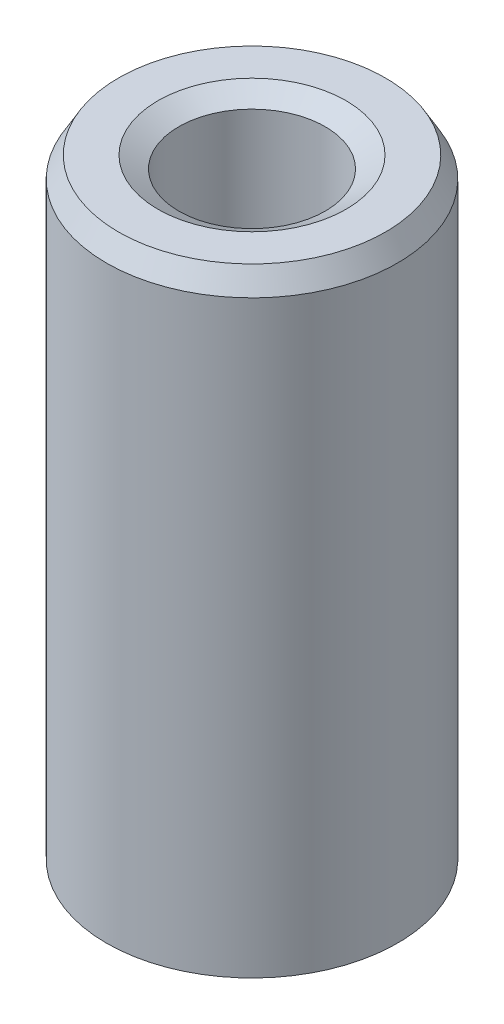
ISO-10303-21;
HEADER;
FILE_DESCRIPTION(('STEP AP214'),'2;1');
FILE_NAME('part.step','',(''),(''),'','','');
FILE_SCHEMA(('AUTOMOTIVE_DESIGN { 1 0 10303 214 1 1 1 1 }'));
ENDSEC;
DATA;
#1=APPLICATION_CONTEXT('core data for automotive mechanical design processes');
#2=APPLICATION_PROTOCOL_DEFINITION('international standard','automotive_design',2000,#1);
#3=PRODUCT_CONTEXT('',#1,'mechanical');
#4=PRODUCT('Part','Part','',(#3));
#5=PRODUCT_RELATED_PRODUCT_CATEGORY('part','',(#4));
#6=PRODUCT_DEFINITION_FORMATION('','',#4);
#7=PRODUCT_DEFINITION_CONTEXT('part definition',#1,'design');
#8=PRODUCT_DEFINITION('design','',#6,#7);
#9=PRODUCT_DEFINITION_SHAPE('','',#8);
#10=(LENGTH_UNIT() NAMED_UNIT(*) SI_UNIT(.MILLI.,.METRE.));
#11=(NAMED_UNIT(*) PLANE_ANGLE_UNIT() SI_UNIT($,.RADIAN.));
#12=(NAMED_UNIT(*) SI_UNIT($,.STERADIAN.) SOLID_ANGLE_UNIT());
#13=UNCERTAINTY_MEASURE_WITH_UNIT(LENGTH_MEASURE(1.E-05),#10,'distance_accuracy_value','');
#14=(GEOMETRIC_REPRESENTATION_CONTEXT(3) GLOBAL_UNCERTAINTY_ASSIGNED_CONTEXT((#13)) GLOBAL_UNIT_ASSIGNED_CONTEXT((#10,
#11,#12)) REPRESENTATION_CONTEXT('',''));
#15=CARTESIAN_POINT('',(0.,0.,0.));
#16=DIRECTION('',(0.,0.,1.));
#17=DIRECTION('',(1.,0.,0.));
#18=AXIS2_PLACEMENT_3D('',#15,#16,#17);
#19=CARTESIAN_POINT('',(0.,106.837301759539,0.));
#20=DIRECTION('',(0.,-1.,0.));
#21=DIRECTION('',(0.,0.,-1.));
#22=AXIS2_PLACEMENT_3D('',#19,#20,#21);
#23=CYLINDRICAL_SURFACE('',#22,25.);
#24=CARTESIAN_POINT('',(0.,2.06871262966936,0.));
#25=DIRECTION('',(0.,1.,0.));
#26=DIRECTION('',(0.,0.,1.));
#27=AXIS2_PLACEMENT_3D('',#24,#25,#26);
#28=CIRCLE('',#27,25.);
#29=CARTESIAN_POINT('',(0.,2.06871262966936,25.));
#30=VERTEX_POINT('',#29);
#31=EDGE_CURVE('E10',#30,#30,#28,.T.);
#32=ORIENTED_EDGE('',*,*,#31,.T.);
#33=EDGE_LOOP('',(#32));
#34=FACE_BOUND('',#33,.T.);
#35=CARTESIAN_POINT('',(0.,103.254186378692,0.));
#36=DIRECTION('',(0.,1.,0.));
#37=DIRECTION('',(0.,0.,1.));
#38=AXIS2_PLACEMENT_3D('',#35,#36,#37);
#39=CIRCLE('',#38,25.);
#40=CARTESIAN_POINT('',(0.,103.254186378692,25.));
#41=VERTEX_POINT('',#40);
#42=EDGE_CURVE('E50',#41,#41,#39,.F.);
#43=ORIENTED_EDGE('',*,*,#42,.T.);
#44=EDGE_LOOP('',(#43));
#45=FACE_BOUND('',#44,.T.);
#46=ADVANCED_FACE('F39',(#34,#45),#23,.T.);
#47=CARTESIAN_POINT('',(0.,106.837301759539,0.));
#48=DIRECTION('',(0.,1.,0.));
#49=DIRECTION('',(0.,0.,1.));
#50=AXIS2_PLACEMENT_3D('',#47,#48,#49);
#51=PLANE('',#50);
#52=CARTESIAN_POINT('',(0.,106.837301759539,0.));
#53=DIRECTION('',(0.,1.,0.));
#54=DIRECTION('',(0.,0.,1.));
#55=AXIS2_PLACEMENT_3D('',#52,#53,#54);
#56=CIRCLE('',#55,16.1614153709822);
#57=CARTESIAN_POINT('',(0.,106.837301759539,16.1614153709821));
#58=VERTEX_POINT('',#57);
#59=EDGE_CURVE('E58',#58,#58,#56,.F.);
#60=ORIENTED_EDGE('',*,*,#59,.T.);
#61=EDGE_LOOP('',(#60));
#62=FACE_BOUND('',#61,.T.);
#63=CARTESIAN_POINT('',(0.,106.837301759539,0.));
#64=DIRECTION('',(0.,1.,0.));
#65=DIRECTION('',(0.,0.,1.));
#66=AXIS2_PLACEMENT_3D('',#63,#64,#65);
#67=CIRCLE('',#66,22.9312873703307);
#68=CARTESIAN_POINT('',(0.,106.837301759539,22.9312873703307));
#69=VERTEX_POINT('',#68);
#70=EDGE_CURVE('E61',#69,#69,#67,.T.);
#71=ORIENTED_EDGE('',*,*,#70,.T.);
#72=EDGE_LOOP('',(#71));
#73=FACE_BOUND('',#72,.T.);
#74=ADVANCED_FACE('F88',(#62,#73),#51,.T.);
#75=CARTESIAN_POINT('',(0.,0.,0.));
#76=DIRECTION('',(0.,1.,0.));
#77=DIRECTION('',(0.,0.,1.));
#78=AXIS2_PLACEMENT_3D('',#75,#76,#77);
#79=PLANE('',#78);
#80=CARTESIAN_POINT('',(0.,0.,0.));
#81=DIRECTION('',(0.,1.,0.));
#82=DIRECTION('',(0.,0.,1.));
#83=AXIS2_PLACEMENT_3D('',#80,#81,#82);
#84=CIRCLE('',#83,14.6470126198047);
#85=CARTESIAN_POINT('',(0.,0.,14.6470126198047));
#86=VERTEX_POINT('',#85);
#87=EDGE_CURVE('E51',#86,#86,#84,.T.);
#88=ORIENTED_EDGE('',*,*,#87,.T.);
#89=EDGE_LOOP('',(#88));
#90=FACE_BOUND('',#89,.T.);
#91=CARTESIAN_POINT('',(0.,0.,0.));
#92=DIRECTION('',(0.,1.,0.));
#93=DIRECTION('',(0.,0.,1.));
#94=AXIS2_PLACEMENT_3D('',#91,#92,#93);
#95=CIRCLE('',#94,21.4168846191532);
#96=CARTESIAN_POINT('',(0.,0.,21.4168846191532));
#97=VERTEX_POINT('',#96);
#98=EDGE_CURVE('E54',#97,#97,#95,.F.);
#99=ORIENTED_EDGE('',*,*,#98,.T.);
#100=EDGE_LOOP('',(#99));
#101=FACE_BOUND('',#100,.T.);
#102=ADVANCED_FACE('F83',(#90,#101),#79,.F.);
#103=CARTESIAN_POINT('',(0.,106.837301759539,0.));
#104=DIRECTION('',(0.,-1.,0.));
#105=DIRECTION('',(0.,0.,-1.));
#106=AXIS2_PLACEMENT_3D('',#103,#104,#105);
#107=CYLINDRICAL_SURFACE('',#106,12.5782999901354);
#108=CARTESIAN_POINT('',(0.,104.76858912987,0.));
#109=DIRECTION('',(0.,1.,0.));
#110=DIRECTION('',(0.,0.,1.));
#111=AXIS2_PLACEMENT_3D('',#108,#109,#110);
#112=CIRCLE('',#111,12.5782999901354);
#113=CARTESIAN_POINT('',(0.,104.76858912987,12.5782999901353));
#114=VERTEX_POINT('',#113);
#115=EDGE_CURVE('E67',#114,#114,#112,.T.);
#116=ORIENTED_EDGE('',*,*,#115,.T.);
#117=EDGE_LOOP('',(#116));
#118=FACE_BOUND('',#117,.T.);
#119=CARTESIAN_POINT('',(0.,3.58311538084678,0.));
#120=DIRECTION('',(0.,1.,0.));
#121=DIRECTION('',(0.,0.,1.));
#122=AXIS2_PLACEMENT_3D('',#119,#120,#121);
#123=CIRCLE('',#122,12.5782999901354);
#124=CARTESIAN_POINT('',(0.,3.58311538084678,12.5782999901354));
#125=VERTEX_POINT('',#124);
#126=EDGE_CURVE('E69',#125,#125,#123,.F.);
#127=ORIENTED_EDGE('',*,*,#126,.T.);
#128=EDGE_LOOP('',(#127));
#129=FACE_BOUND('',#128,.T.);
#130=ADVANCED_FACE('F71',(#118,#129),#107,.F.);
#131=CARTESIAN_POINT('',(0.,104.76858912987,0.));
#132=DIRECTION('',(0.,1.,0.));
#133=DIRECTION('',(0.,0.,1.));
#134=AXIS2_PLACEMENT_3D('',#131,#132,#133);
#135=CONICAL_SURFACE('',#134,12.5782999901354,1.0471975511966);
#136=CARTESIAN_POINT('',(0.,106.837301759539,16.1614153709821));
#137=CARTESIAN_POINT('',(0.,106.815752669647,16.1240912524317));
#138=CARTESIAN_POINT('',(0.,106.794203579754,16.0867671338812));
#139=CARTESIAN_POINT('',(0.,106.751105399969,16.0121188967802));
#140=CARTESIAN_POINT('',(0.,106.729556310077,15.9747947782297));
#141=CARTESIAN_POINT('',(0.,106.686458130292,15.9001465411287));
#142=CARTESIAN_POINT('',(0.,106.6649090404,15.8628224225782));
#143=CARTESIAN_POINT('',(0.,106.621810860615,15.7881741854773));
#144=CARTESIAN_POINT('',(0.,106.600261770723,15.7508500669268));
#145=CARTESIAN_POINT('',(0.,106.557163590938,15.6762018298258));
#146=CARTESIAN_POINT('',(0.,106.535614501046,15.6388777112753));
#147=CARTESIAN_POINT('',(0.,106.492516321261,15.5642294741743));
#148=CARTESIAN_POINT('',(0.,106.470967231368,15.5269053556239));
#149=CARTESIAN_POINT('',(0.,106.427869051584,15.4522571185229));
#150=CARTESIAN_POINT('',(0.,106.406319961691,15.4149329999724));
#151=CARTESIAN_POINT('',(0.,106.363221781906,15.3402847628714));
#152=CARTESIAN_POINT('',(0.,106.341672692014,15.3029606443209));
#153=CARTESIAN_POINT('',(0.,106.298574512229,15.22831240722));
#154=CARTESIAN_POINT('',(0.,106.277025422337,15.1909882886695));
#155=CARTESIAN_POINT('',(0.,106.233927242552,15.1163400515685));
#156=CARTESIAN_POINT('',(0.,106.21237815266,15.079015933018));
#157=CARTESIAN_POINT('',(0.,106.169279972875,15.004367695917));
#158=CARTESIAN_POINT('',(0.,106.147730882983,14.9670435773665));
#159=CARTESIAN_POINT('',(0.,106.104632703198,14.8923953402656));
#160=CARTESIAN_POINT('',(0.,106.083083613305,14.8550712217151));
#161=CARTESIAN_POINT('',(0.,106.039985433521,14.7804229846141));
#162=CARTESIAN_POINT('',(0.,106.018436343628,14.7430988660636));
#163=CARTESIAN_POINT('',(0.,105.975338163843,14.6684506289626));
#164=CARTESIAN_POINT('',(0.,105.953789073951,14.6311265104122));
#165=CARTESIAN_POINT('',(0.,105.910690894166,14.5564782733112));
#166=CARTESIAN_POINT('',(0.,105.889141804274,14.5191541547607));
#167=CARTESIAN_POINT('',(0.,105.846043624489,14.4445059176597));
#168=CARTESIAN_POINT('',(0.,105.824494534597,14.4071817991092));
#169=CARTESIAN_POINT('',(0.,105.781396354812,14.3325335620083));
#170=CARTESIAN_POINT('',(0.,105.75984726492,14.2952094434578));
#171=CARTESIAN_POINT('',(0.,105.716749085135,14.2205612063568));
#172=CARTESIAN_POINT('',(0.,105.695199995242,14.1832370878063));
#173=CARTESIAN_POINT('',(0.,105.652101815458,14.1085888507053));
#174=CARTESIAN_POINT('',(0.,105.630552725565,14.0712647321548));
#175=CARTESIAN_POINT('',(0.,105.58745454578,13.9966164950539));
#176=CARTESIAN_POINT('',(0.,105.565905455888,13.9592923765034));
#177=CARTESIAN_POINT('',(0.,105.522807276103,13.8846441394024));
#178=CARTESIAN_POINT('',(0.,105.501258186211,13.8473200208519));
#179=CARTESIAN_POINT('',(0.,105.458160006426,13.7726717837509));
#180=CARTESIAN_POINT('',(0.,105.436610916534,13.7353476652005));
#181=CARTESIAN_POINT('',(0.,105.393512736749,13.6606994280995));
#182=CARTESIAN_POINT('',(0.,105.371963646856,13.623375309549));
#183=CARTESIAN_POINT('',(0.,105.328865467072,13.548727072448));
#184=CARTESIAN_POINT('',(0.,105.307316377179,13.5114029538975));
#185=CARTESIAN_POINT('',(0.,105.264218197395,13.4367547167966));
#186=CARTESIAN_POINT('',(0.,105.242669107502,13.3994305982461));
#187=CARTESIAN_POINT('',(0.,105.199570927717,13.3247823611451));
#188=CARTESIAN_POINT('',(0.,105.178021837825,13.2874582425946));
#189=CARTESIAN_POINT('',(0.,105.13492365804,13.2128100054936));
#190=CARTESIAN_POINT('',(0.,105.113374568148,13.1754858869432));
#191=CARTESIAN_POINT('',(0.,105.070276388363,13.1008376498422));
#192=CARTESIAN_POINT('',(0.,105.048727298471,13.0635135312917));
#193=CARTESIAN_POINT('',(0.,105.005629118686,12.9888652941907));
#194=CARTESIAN_POINT('',(0.,104.984080028793,12.9515411756402));
#195=CARTESIAN_POINT('',(0.,104.940981849009,12.8768929385392));
#196=CARTESIAN_POINT('',(0.,104.919432759116,12.8395688199888));
#197=CARTESIAN_POINT('',(0.,104.876334579332,12.7649205828878));
#198=CARTESIAN_POINT('',(0.,104.854785489439,12.7275964643373));
#199=CARTESIAN_POINT('',(0.,104.811687309654,12.6529482272363));
#200=CARTESIAN_POINT('',(0.,104.790138219762,12.6156241086858));
#201=CARTESIAN_POINT('',(0.,104.76858912987,12.5782999901353));
#202=B_SPLINE_CURVE_WITH_KNOTS('',3,(#136,#137,#138,#139,#140,#141,#142,#143,#144,#145,#146,
#147,#148,#149,#150,#151,#152,#153,#154,#155,#156,#157,#158,#159,#160,#161,#162,#163,#164,#165,
#166,#167,#168,#169,#170,#171,#172,#173,#174,#175,#176,#177,#178,#179,#180,#181,#182,#183,#184,
#185,#186,#187,#188,#189,#190,#191,#192,#193,#194,#195,#196,#197,#198,#199,#200,#201),
.UNSPECIFIED.,.F.,.F.,(4,2,2,2,2,2,2,2,2,2,2,2,2,2,2,2,2,2,2,2,2,2,2,2,2,2,2,2,2,2,2,2,4),(0.,
0.129294539354337,0.258589078708677,0.387883618063014,0.517178157417351,0.646472696771683,
0.775767236126021,0.905061775480358,1.0343563148347,1.16365085418903,1.29294539354336,
1.4222399328977,1.55153447225204,1.68082901160638,1.81012355096071,1.93941809031505,
2.06871262966939,2.19800716902372,2.32730170837806,2.45659624773239,2.58589078708673,
2.71518532644107,2.8444798657954,2.97377440514974,3.10306894450407,3.23236348385841,
3.36165802321275,3.49095256256709,3.62024710192142,3.74954164127576,3.87883618063009,
4.00813071998443,4.13742525933876),.UNSPECIFIED.);
#203=EDGE_CURVE('BSEAM77',#58,#114,#202,.T.);
#204=ORIENTED_EDGE('',*,*,#59,.F.);
#205=ORIENTED_EDGE('',*,*,#115,.F.);
#206=ORIENTED_EDGE('',*,*,#203,.T.);
#207=ORIENTED_EDGE('',*,*,#203,.F.);
#208=EDGE_LOOP('',(#204,#206,#205,#207));
#209=FACE_BOUND('',#208,.T.);
#210=ADVANCED_FACE('F77',(#209),#135,.F.);
#211=CARTESIAN_POINT('',(0.,0.,0.));
#212=DIRECTION('',(0.,-1.,0.));
#213=DIRECTION('',(0.,0.,-1.));
#214=AXIS2_PLACEMENT_3D('',#211,#212,#213);
#215=CONICAL_SURFACE('',#214,14.6470126198047,0.523598775598294);
#216=ORIENTED_EDGE('',*,*,#126,.F.);
#217=EDGE_LOOP('',(#216));
#218=FACE_BOUND('',#217,.T.);
#219=ORIENTED_EDGE('',*,*,#87,.F.);
#220=EDGE_LOOP('',(#219));
#221=FACE_BOUND('',#220,.T.);
#222=ADVANCED_FACE('F73',(#218,#221),#215,.F.);
#223=CARTESIAN_POINT('',(0.,2.06871262966936,0.));
#224=DIRECTION('',(0.,1.,0.));
#225=DIRECTION('',(0.,0.,1.));
#226=AXIS2_PLACEMENT_3D('',#223,#224,#225);
#227=CONICAL_SURFACE('',#226,25.,1.0471975511966);
#228=CARTESIAN_POINT('',(0.,0.,21.4168846191532));
#229=CARTESIAN_POINT('',(0.,0.0215490898923888,21.4542087377037));
#230=CARTESIAN_POINT('',(0.,0.0430981797847779,21.4915328562542));
#231=CARTESIAN_POINT('',(0.,0.0861963595695561,21.5661810933552));
#232=CARTESIAN_POINT('',(0.,0.107745449461945,21.6035052119057));
#233=CARTESIAN_POINT('',(0.,0.150843629246723,21.6781534490066));
#234=CARTESIAN_POINT('',(0.,0.172392719139113,21.7154775675571));
#235=CARTESIAN_POINT('',(0.,0.215490898923891,21.7901258046581));
#236=CARTESIAN_POINT('',(0.,0.23703998881628,21.8274499232086));
#237=CARTESIAN_POINT('',(0.,0.280138168601058,21.9020981603096));
#238=CARTESIAN_POINT('',(0.,0.301687258493447,21.93942227886));
#239=CARTESIAN_POINT('',(0.,0.344785438278226,22.014070515961));
#240=CARTESIAN_POINT('',(0.,0.366334528170615,22.0513946345115));
#241=CARTESIAN_POINT('',(0.,0.409432707955393,22.1260428716125));
#242=CARTESIAN_POINT('',(0.,0.430981797847783,22.163366990163));
#243=CARTESIAN_POINT('',(0.,0.474079977632561,22.2380152272639));
#244=CARTESIAN_POINT('',(0.,0.49562906752495,22.2753393458144));
#245=CARTESIAN_POINT('',(0.,0.538727247309728,22.3499875829154));
#246=CARTESIAN_POINT('',(0.,0.560276337202118,22.3873117014659));
#247=CARTESIAN_POINT('',(0.,0.603374516986896,22.4619599385669));
#248=CARTESIAN_POINT('',(0.,0.624923606879285,22.4992840571174));
#249=CARTESIAN_POINT('',(0.,0.668021786664063,22.5739322942183));
#250=CARTESIAN_POINT('',(0.,0.689570876556453,22.6112564127688));
#251=CARTESIAN_POINT('',(0.,0.732669056341231,22.6859046498698));
#252=CARTESIAN_POINT('',(0.,0.75421814623362,22.7232287684203));
#253=CARTESIAN_POINT('',(0.,0.797316326018398,22.7978770055213));
#254=CARTESIAN_POINT('',(0.,0.818865415910787,22.8352011240717));
#255=CARTESIAN_POINT('',(0.,0.861963595695566,22.9098493611727));
#256=CARTESIAN_POINT('',(0.,0.883512685587955,22.9471734797232));
#257=CARTESIAN_POINT('',(0.,0.926610865372733,23.0218217168242));
#258=CARTESIAN_POINT('',(0.,0.948159955265123,23.0591458353747));
#259=CARTESIAN_POINT('',(0.,0.991258135049901,23.1337940724756));
#260=CARTESIAN_POINT('',(0.,1.01280722494229,23.1711181910261));
#261=CARTESIAN_POINT('',(0.,1.05590540472707,23.2457664281271));
#262=CARTESIAN_POINT('',(0.,1.07745449461946,23.2830905466776));
#263=CARTESIAN_POINT('',(0.,1.12055267440424,23.3577387837786));
#264=CARTESIAN_POINT('',(0.,1.14210176429662,23.395062902329));
#265=CARTESIAN_POINT('',(0.,1.1851999440814,23.46971113943));
#266=CARTESIAN_POINT('',(0.,1.20674903397379,23.5070352579805));
#267=CARTESIAN_POINT('',(0.,1.24984721375857,23.5816834950815));
#268=CARTESIAN_POINT('',(0.,1.27139630365096,23.619007613632));
#269=CARTESIAN_POINT('',(0.,1.31449448343574,23.6936558507329));
#270=CARTESIAN_POINT('',(0.,1.33604357332813,23.7309799692834));
#271=CARTESIAN_POINT('',(0.,1.37914175311291,23.8056282063844));
#272=CARTESIAN_POINT('',(0.,1.40069084300529,23.8429523249349));
#273=CARTESIAN_POINT('',(0.,1.44378902279007,23.9176005620359));
#274=CARTESIAN_POINT('',(0.,1.46533811268246,23.9549246805864));
#275=CARTESIAN_POINT('',(0.,1.50843629246724,24.0295729176873));
#276=CARTESIAN_POINT('',(0.,1.52998538235963,24.0668970362378));
#277=CARTESIAN_POINT('',(0.,1.57308356214441,24.1415452733388));
#278=CARTESIAN_POINT('',(0.,1.5946326520368,24.1788693918893));
#279=CARTESIAN_POINT('',(0.,1.63773083182158,24.2535176289903));
#280=CARTESIAN_POINT('',(0.,1.65927992171396,24.2908417475407));
#281=CARTESIAN_POINT('',(0.,1.70237810149874,24.3654899846417));
#282=CARTESIAN_POINT('',(0.,1.72392719139113,24.4028141031922));
#283=CARTESIAN_POINT('',(0.,1.76702537117591,24.4774623402932));
#284=CARTESIAN_POINT('',(0.,1.7885744610683,24.5147864588437));
#285=CARTESIAN_POINT('',(0.,1.83167264085308,24.5894346959446));
#286=CARTESIAN_POINT('',(0.,1.85322173074547,24.6267588144951));
#287=CARTESIAN_POINT('',(0.,1.89631991053025,24.7014070515961));
#288=CARTESIAN_POINT('',(0.,1.91786900042263,24.7387311701466));
#289=CARTESIAN_POINT('',(0.,1.96096718020741,24.8133794072476));
#290=CARTESIAN_POINT('',(0.,1.9825162700998,24.8507035257981));
#291=CARTESIAN_POINT('',(0.,2.02561444988458,24.925351762899));
#292=CARTESIAN_POINT('',(0.,2.04716353977697,24.9626758814495));
#293=CARTESIAN_POINT('',(0.,2.06871262966936,25.));
#294=B_SPLINE_CURVE_WITH_KNOTS('',3,(#228,#229,#230,#231,#232,#233,#234,#235,#236,#237,#238,
#239,#240,#241,#242,#243,#244,#245,#246,#247,#248,#249,#250,#251,#252,#253,#254,#255,#256,#257,
#258,#259,#260,#261,#262,#263,#264,#265,#266,#267,#268,#269,#270,#271,#272,#273,#274,#275,#276,
#277,#278,#279,#280,#281,#282,#283,#284,#285,#286,#287,#288,#289,#290,#291,#292,#293),
.UNSPECIFIED.,.F.,.F.,(4,2,2,2,2,2,2,2,2,2,2,2,2,2,2,2,2,2,2,2,2,2,2,2,2,2,2,2,2,2,2,2,4),(0.,
0.129294539354335,0.258589078708671,0.387883618063006,0.517178157417342,0.646472696771677,
0.775767236126013,0.905061775480348,1.03435631483468,1.16365085418902,1.29294539354335,
1.42223993289769,1.55153447225203,1.68082901160636,1.8101235509607,1.93941809031503,
2.06871262966937,2.19800716902371,2.32730170837804,2.45659624773238,2.58589078708671,
2.71518532644105,2.84447986579538,2.97377440514972,3.10306894450405,3.23236348385839,
3.36165802321273,3.49095256256706,3.6202471019214,3.74954164127573,3.87883618063007,
4.0081307199844,4.13742525933874),.UNSPECIFIED.);
#295=EDGE_CURVE('BSEAM76',#97,#30,#294,.T.);
#296=ORIENTED_EDGE('',*,*,#98,.F.);
#297=ORIENTED_EDGE('',*,*,#31,.F.);
#298=ORIENTED_EDGE('',*,*,#295,.T.);
#299=ORIENTED_EDGE('',*,*,#295,.F.);
#300=EDGE_LOOP('',(#296,#298,#297,#299));
#301=FACE_BOUND('',#300,.T.);
#302=ADVANCED_FACE('F76',(#301),#227,.T.);
#303=CARTESIAN_POINT('',(0.,106.837301759539,0.));
#304=DIRECTION('',(0.,-1.,0.));
#305=DIRECTION('',(0.,0.,-1.));
#306=AXIS2_PLACEMENT_3D('',#303,#304,#305);
#307=CONICAL_SURFACE('',#306,22.9312873703307,0.523598775598295);
#308=ORIENTED_EDGE('',*,*,#42,.F.);
#309=EDGE_LOOP('',(#308));
#310=FACE_BOUND('',#309,.T.);
#311=ORIENTED_EDGE('',*,*,#70,.F.);
#312=EDGE_LOOP('',(#311));
#313=FACE_BOUND('',#312,.T.);
#314=ADVANCED_FACE('F45',(#310,#313),#307,.T.);
#315=CLOSED_SHELL('',(#46,#74,#102,#130,#210,#222,#302,#314));
#316=MANIFOLD_SOLID_BREP('B2',#315);
#317=ADVANCED_BREP_SHAPE_REPRESENTATION('',(#18,#316),#14);
#318=SHAPE_DEFINITION_REPRESENTATION(#9,#317);
ENDSEC;
END-ISO-10303-21;
